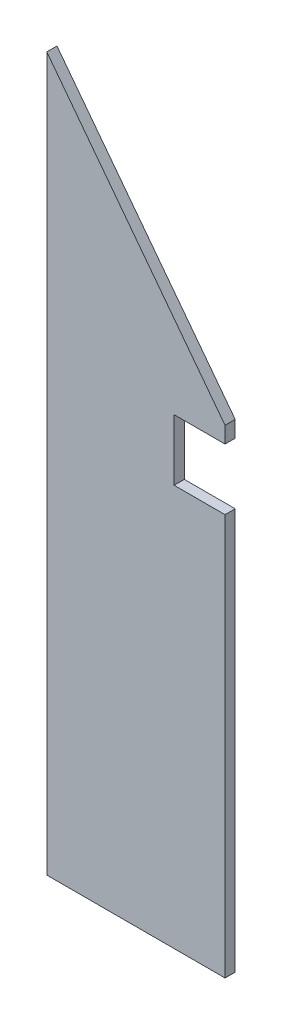
ISO-10303-21;
HEADER;
FILE_DESCRIPTION(('STEP AP214'),'2;1');
FILE_NAME('part.step','',(''),(''),'','','');
FILE_SCHEMA(('AUTOMOTIVE_DESIGN { 1 0 10303 214 1 1 1 1 }'));
ENDSEC;
DATA;
#1=APPLICATION_CONTEXT('core data for automotive mechanical design processes');
#2=APPLICATION_PROTOCOL_DEFINITION('international standard','automotive_design',2000,#1);
#3=PRODUCT_CONTEXT('',#1,'mechanical');
#4=PRODUCT('Part','Part','',(#3));
#5=PRODUCT_RELATED_PRODUCT_CATEGORY('part','',(#4));
#6=PRODUCT_DEFINITION_FORMATION('','',#4);
#7=PRODUCT_DEFINITION_CONTEXT('part definition',#1,'design');
#8=PRODUCT_DEFINITION('design','',#6,#7);
#9=PRODUCT_DEFINITION_SHAPE('','',#8);
#10=(LENGTH_UNIT() NAMED_UNIT(*) SI_UNIT(.MILLI.,.METRE.));
#11=(NAMED_UNIT(*) PLANE_ANGLE_UNIT() SI_UNIT($,.RADIAN.));
#12=(NAMED_UNIT(*) SI_UNIT($,.STERADIAN.) SOLID_ANGLE_UNIT());
#13=UNCERTAINTY_MEASURE_WITH_UNIT(LENGTH_MEASURE(1.E-05),#10,'distance_accuracy_value','');
#14=(GEOMETRIC_REPRESENTATION_CONTEXT(3) GLOBAL_UNCERTAINTY_ASSIGNED_CONTEXT((#13)) GLOBAL_UNIT_ASSIGNED_CONTEXT((#10,
#11,#12)) REPRESENTATION_CONTEXT('',''));
#15=CARTESIAN_POINT('',(0.,0.,0.));
#16=DIRECTION('',(0.,0.,1.));
#17=DIRECTION('',(1.,0.,0.));
#18=AXIS2_PLACEMENT_3D('',#15,#16,#17);
#19=CARTESIAN_POINT('',(0.,0.,5.));
#20=DIRECTION('',(1.,0.,0.));
#21=DIRECTION('',(0.,0.,-1.));
#22=AXIS2_PLACEMENT_3D('',#19,#20,#21);
#23=PLANE('',#22);
#24=DIRECTION('',(0.,-1.,0.));
#25=VECTOR('',#24,1.);
#26=CARTESIAN_POINT('',(0.,0.,0.));
#27=LINE('',#26,#25);
#28=CARTESIAN_POINT('',(0.,350.,0.));
#29=VERTEX_POINT('',#28);
#30=CARTESIAN_POINT('',(0.,0.,0.));
#31=VERTEX_POINT('',#30);
#32=EDGE_CURVE('E151',#29,#31,#27,.T.);
#33=ORIENTED_EDGE('',*,*,#32,.T.);
#34=DIRECTION('',(0.,0.,-1.));
#35=VECTOR('',#34,1.);
#36=CARTESIAN_POINT('',(0.,0.,5.));
#37=LINE('',#36,#35);
#38=CARTESIAN_POINT('',(0.,0.,5.));
#39=VERTEX_POINT('',#38);
#40=EDGE_CURVE('E12',#39,#31,#37,.T.);
#41=ORIENTED_EDGE('',*,*,#40,.F.);
#42=DIRECTION('',(0.,-1.,0.));
#43=VECTOR('',#42,1.);
#44=CARTESIAN_POINT('',(0.,0.,5.));
#45=LINE('',#44,#43);
#46=CARTESIAN_POINT('',(0.,350.,5.));
#47=VERTEX_POINT('',#46);
#48=EDGE_CURVE('E165',#47,#39,#45,.T.);
#49=ORIENTED_EDGE('',*,*,#48,.F.);
#50=DIRECTION('',(0.,0.,-1.));
#51=VECTOR('',#50,1.);
#52=CARTESIAN_POINT('',(0.,350.,5.));
#53=LINE('',#52,#51);
#54=EDGE_CURVE('E147',#47,#29,#53,.T.);
#55=ORIENTED_EDGE('',*,*,#54,.T.);
#56=EDGE_LOOP('',(#33,#41,#49,#55));
#57=FACE_BOUND('',#56,.T.);
#58=ADVANCED_FACE('F55',(#57),#23,.F.);
#59=CARTESIAN_POINT('',(0.,0.,5.));
#60=DIRECTION('',(0.,1.,0.));
#61=DIRECTION('',(0.,0.,1.));
#62=AXIS2_PLACEMENT_3D('',#59,#60,#61);
#63=PLANE('',#62);
#64=DIRECTION('',(1.,0.,0.));
#65=VECTOR('',#64,1.);
#66=CARTESIAN_POINT('',(0.,0.,0.));
#67=LINE('',#66,#65);
#68=CARTESIAN_POINT('',(87.5,0.,0.));
#69=VERTEX_POINT('',#68);
#70=EDGE_CURVE('E154',#31,#69,#67,.T.);
#71=ORIENTED_EDGE('',*,*,#70,.T.);
#72=DIRECTION('',(0.,0.,-1.));
#73=VECTOR('',#72,1.);
#74=CARTESIAN_POINT('',(87.5,0.,5.));
#75=LINE('',#74,#73);
#76=CARTESIAN_POINT('',(87.5,0.,5.));
#77=VERTEX_POINT('',#76);
#78=EDGE_CURVE('E63',#77,#69,#75,.T.);
#79=ORIENTED_EDGE('',*,*,#78,.F.);
#80=DIRECTION('',(1.,0.,0.));
#81=VECTOR('',#80,1.);
#82=CARTESIAN_POINT('',(0.,0.,5.));
#83=LINE('',#82,#81);
#84=EDGE_CURVE('E114',#39,#77,#83,.T.);
#85=ORIENTED_EDGE('',*,*,#84,.F.);
#86=ORIENTED_EDGE('',*,*,#40,.T.);
#87=EDGE_LOOP('',(#71,#79,#85,#86));
#88=FACE_BOUND('',#87,.T.);
#89=ADVANCED_FACE('F200',(#88),#63,.F.);
#90=CARTESIAN_POINT('',(87.5,0.,5.));
#91=DIRECTION('',(-1.,0.,0.));
#92=DIRECTION('',(0.,0.,1.));
#93=AXIS2_PLACEMENT_3D('',#90,#91,#92);
#94=PLANE('',#93);
#95=DIRECTION('',(0.,1.,0.));
#96=VECTOR('',#95,1.);
#97=CARTESIAN_POINT('',(87.5,0.,0.));
#98=LINE('',#97,#96);
#99=CARTESIAN_POINT('',(87.5,197.,0.));
#100=VERTEX_POINT('',#99);
#101=EDGE_CURVE('E156',#69,#100,#98,.T.);
#102=ORIENTED_EDGE('',*,*,#101,.T.);
#103=DIRECTION('',(0.,0.,-1.));
#104=VECTOR('',#103,1.);
#105=CARTESIAN_POINT('',(87.5,197.,5.));
#106=LINE('',#105,#104);
#107=CARTESIAN_POINT('',(87.5,197.,5.));
#108=VERTEX_POINT('',#107);
#109=EDGE_CURVE('E172',#108,#100,#106,.T.);
#110=ORIENTED_EDGE('',*,*,#109,.F.);
#111=DIRECTION('',(0.,1.,0.));
#112=VECTOR('',#111,1.);
#113=CARTESIAN_POINT('',(87.5,0.,5.));
#114=LINE('',#113,#112);
#115=EDGE_CURVE('E180',#77,#108,#114,.T.);
#116=ORIENTED_EDGE('',*,*,#115,.F.);
#117=ORIENTED_EDGE('',*,*,#78,.T.);
#118=EDGE_LOOP('',(#102,#110,#116,#117));
#119=FACE_BOUND('',#118,.T.);
#120=ADVANCED_FACE('F178',(#119),#94,.F.);
#121=CARTESIAN_POINT('',(87.5,197.,5.));
#122=DIRECTION('',(0.,-1.,0.));
#123=DIRECTION('',(0.,0.,-1.));
#124=AXIS2_PLACEMENT_3D('',#121,#122,#123);
#125=PLANE('',#124);
#126=DIRECTION('',(-1.,0.,0.));
#127=VECTOR('',#126,1.);
#128=CARTESIAN_POINT('',(87.5,197.,0.));
#129=LINE('',#128,#127);
#130=CARTESIAN_POINT('',(62.5,197.,0.));
#131=VERTEX_POINT('',#130);
#132=EDGE_CURVE('E158',#100,#131,#129,.T.);
#133=ORIENTED_EDGE('',*,*,#132,.T.);
#134=DIRECTION('',(0.,0.,-1.));
#135=VECTOR('',#134,1.);
#136=CARTESIAN_POINT('',(62.5,197.,5.));
#137=LINE('',#136,#135);
#138=CARTESIAN_POINT('',(62.5,197.,5.));
#139=VERTEX_POINT('',#138);
#140=EDGE_CURVE('E169',#139,#131,#137,.T.);
#141=ORIENTED_EDGE('',*,*,#140,.F.);
#142=DIRECTION('',(-1.,0.,0.));
#143=VECTOR('',#142,1.);
#144=CARTESIAN_POINT('',(87.5,197.,5.));
#145=LINE('',#144,#143);
#146=EDGE_CURVE('E192',#108,#139,#145,.T.);
#147=ORIENTED_EDGE('',*,*,#146,.F.);
#148=ORIENTED_EDGE('',*,*,#109,.T.);
#149=EDGE_LOOP('',(#133,#141,#147,#148));
#150=FACE_BOUND('',#149,.T.);
#151=ADVANCED_FACE('F188',(#150),#125,.F.);
#152=CARTESIAN_POINT('',(62.5,197.,5.));
#153=DIRECTION('',(-1.,0.,0.));
#154=DIRECTION('',(0.,0.,1.));
#155=AXIS2_PLACEMENT_3D('',#152,#153,#154);
#156=PLANE('',#155);
#157=DIRECTION('',(0.,1.,0.));
#158=VECTOR('',#157,1.);
#159=CARTESIAN_POINT('',(62.5,197.,0.));
#160=LINE('',#159,#158);
#161=CARTESIAN_POINT('',(62.5,227.,0.));
#162=VERTEX_POINT('',#161);
#163=EDGE_CURVE('E160',#131,#162,#160,.T.);
#164=ORIENTED_EDGE('',*,*,#163,.T.);
#165=DIRECTION('',(0.,0.,-1.));
#166=VECTOR('',#165,1.);
#167=CARTESIAN_POINT('',(62.5,227.,5.));
#168=LINE('',#167,#166);
#169=CARTESIAN_POINT('',(62.5,227.,5.));
#170=VERTEX_POINT('',#169);
#171=EDGE_CURVE('E142',#170,#162,#168,.T.);
#172=ORIENTED_EDGE('',*,*,#171,.F.);
#173=DIRECTION('',(0.,1.,0.));
#174=VECTOR('',#173,1.);
#175=CARTESIAN_POINT('',(62.5,197.,5.));
#176=LINE('',#175,#174);
#177=EDGE_CURVE('E133',#139,#170,#176,.T.);
#178=ORIENTED_EDGE('',*,*,#177,.F.);
#179=ORIENTED_EDGE('',*,*,#140,.T.);
#180=EDGE_LOOP('',(#164,#172,#178,#179));
#181=FACE_BOUND('',#180,.T.);
#182=ADVANCED_FACE('F191',(#181),#156,.F.);
#183=CARTESIAN_POINT('',(62.5,227.,5.));
#184=DIRECTION('',(0.,1.,0.));
#185=DIRECTION('',(0.,0.,1.));
#186=AXIS2_PLACEMENT_3D('',#183,#184,#185);
#187=PLANE('',#186);
#188=DIRECTION('',(1.,0.,0.));
#189=VECTOR('',#188,1.);
#190=CARTESIAN_POINT('',(62.5,227.,0.));
#191=LINE('',#190,#189);
#192=CARTESIAN_POINT('',(87.5,227.,0.));
#193=VERTEX_POINT('',#192);
#194=EDGE_CURVE('E141',#162,#193,#191,.T.);
#195=ORIENTED_EDGE('',*,*,#194,.T.);
#196=DIRECTION('',(0.,0.,-1.));
#197=VECTOR('',#196,1.);
#198=CARTESIAN_POINT('',(87.5,227.,5.));
#199=LINE('',#198,#197);
#200=CARTESIAN_POINT('',(87.5,227.,5.));
#201=VERTEX_POINT('',#200);
#202=EDGE_CURVE('E138',#201,#193,#199,.T.);
#203=ORIENTED_EDGE('',*,*,#202,.F.);
#204=DIRECTION('',(1.,0.,0.));
#205=VECTOR('',#204,1.);
#206=CARTESIAN_POINT('',(62.5,227.,5.));
#207=LINE('',#206,#205);
#208=EDGE_CURVE('E127',#170,#201,#207,.T.);
#209=ORIENTED_EDGE('',*,*,#208,.F.);
#210=ORIENTED_EDGE('',*,*,#171,.T.);
#211=EDGE_LOOP('',(#195,#203,#209,#210));
#212=FACE_BOUND('',#211,.T.);
#213=ADVANCED_FACE('F139',(#212),#187,.F.);
#214=CARTESIAN_POINT('',(87.5,227.,5.));
#215=DIRECTION('',(-1.,0.,0.));
#216=DIRECTION('',(0.,0.,1.));
#217=AXIS2_PLACEMENT_3D('',#214,#215,#216);
#218=PLANE('',#217);
#219=DIRECTION('',(0.,1.,0.));
#220=VECTOR('',#219,1.);
#221=CARTESIAN_POINT('',(87.5,227.,0.));
#222=LINE('',#221,#220);
#223=CARTESIAN_POINT('',(87.5,235.,0.));
#224=VERTEX_POINT('',#223);
#225=EDGE_CURVE('E100',#193,#224,#222,.T.);
#226=ORIENTED_EDGE('',*,*,#225,.T.);
#227=DIRECTION('',(0.,0.,-1.));
#228=VECTOR('',#227,1.);
#229=CARTESIAN_POINT('',(87.5,235.,5.));
#230=LINE('',#229,#228);
#231=CARTESIAN_POINT('',(87.5,235.,5.));
#232=VERTEX_POINT('',#231);
#233=EDGE_CURVE('E143',#232,#224,#230,.T.);
#234=ORIENTED_EDGE('',*,*,#233,.F.);
#235=DIRECTION('',(0.,1.,0.));
#236=VECTOR('',#235,1.);
#237=CARTESIAN_POINT('',(87.5,227.,5.));
#238=LINE('',#237,#236);
#239=EDGE_CURVE('E131',#201,#232,#238,.T.);
#240=ORIENTED_EDGE('',*,*,#239,.F.);
#241=ORIENTED_EDGE('',*,*,#202,.T.);
#242=EDGE_LOOP('',(#226,#234,#240,#241));
#243=FACE_BOUND('',#242,.T.);
#244=ADVANCED_FACE('F145',(#243),#218,.F.);
#245=CARTESIAN_POINT('',(0.,350.,5.));
#246=DIRECTION('',(-0.795828694120859,-0.605521832483262,0.));
#247=DIRECTION('',(0.605521832483262,-0.795828694120859,0.));
#248=AXIS2_PLACEMENT_3D('',#245,#246,#247);
#249=PLANE('',#248);
#250=DIRECTION('',(-0.605521832483262,0.795828694120859,0.));
#251=VECTOR('',#250,1.);
#252=CARTESIAN_POINT('',(0.,350.,0.));
#253=LINE('',#252,#251);
#254=EDGE_CURVE('E106',#224,#29,#253,.T.);
#255=ORIENTED_EDGE('',*,*,#254,.T.);
#256=ORIENTED_EDGE('',*,*,#54,.F.);
#257=DIRECTION('',(-0.605521832483262,0.795828694120859,0.));
#258=VECTOR('',#257,1.);
#259=CARTESIAN_POINT('',(0.,350.,5.));
#260=LINE('',#259,#258);
#261=EDGE_CURVE('E71',#232,#47,#260,.T.);
#262=ORIENTED_EDGE('',*,*,#261,.F.);
#263=ORIENTED_EDGE('',*,*,#233,.T.);
#264=EDGE_LOOP('',(#255,#256,#262,#263));
#265=FACE_BOUND('',#264,.T.);
#266=ADVANCED_FACE('F216',(#265),#249,.F.);
#267=CARTESIAN_POINT('',(0.,0.,5.));
#268=DIRECTION('',(0.,0.,-1.));
#269=DIRECTION('',(-1.,0.,0.));
#270=AXIS2_PLACEMENT_3D('',#267,#268,#269);
#271=PLANE('',#270);
#272=ORIENTED_EDGE('',*,*,#48,.T.);
#273=ORIENTED_EDGE('',*,*,#84,.T.);
#274=ORIENTED_EDGE('',*,*,#115,.T.);
#275=ORIENTED_EDGE('',*,*,#146,.T.);
#276=ORIENTED_EDGE('',*,*,#177,.T.);
#277=ORIENTED_EDGE('',*,*,#208,.T.);
#278=ORIENTED_EDGE('',*,*,#239,.T.);
#279=ORIENTED_EDGE('',*,*,#261,.T.);
#280=EDGE_LOOP('',(#272,#273,#274,#275,#276,#277,#278,#279));
#281=FACE_BOUND('',#280,.T.);
#282=ADVANCED_FACE('F129',(#281),#271,.F.);
#283=CARTESIAN_POINT('',(0.,0.,0.));
#284=DIRECTION('',(0.,0.,-1.));
#285=DIRECTION('',(-1.,0.,0.));
#286=AXIS2_PLACEMENT_3D('',#283,#284,#285);
#287=PLANE('',#286);
#288=ORIENTED_EDGE('',*,*,#32,.F.);
#289=ORIENTED_EDGE('',*,*,#254,.F.);
#290=ORIENTED_EDGE('',*,*,#225,.F.);
#291=ORIENTED_EDGE('',*,*,#194,.F.);
#292=ORIENTED_EDGE('',*,*,#163,.F.);
#293=ORIENTED_EDGE('',*,*,#132,.F.);
#294=ORIENTED_EDGE('',*,*,#101,.F.);
#295=ORIENTED_EDGE('',*,*,#70,.F.);
#296=EDGE_LOOP('',(#288,#289,#290,#291,#292,#293,#294,#295));
#297=FACE_BOUND('',#296,.T.);
#298=ADVANCED_FACE('F184',(#297),#287,.T.);
#299=CLOSED_SHELL('',(#58,#89,#120,#151,#182,#213,#244,#266,#282,#298));
#300=MANIFOLD_SOLID_BREP('B2',#299);
#301=ADVANCED_BREP_SHAPE_REPRESENTATION('',(#18,#300),#14);
#302=SHAPE_DEFINITION_REPRESENTATION(#9,#301);
ENDSEC;
END-ISO-10303-21;
